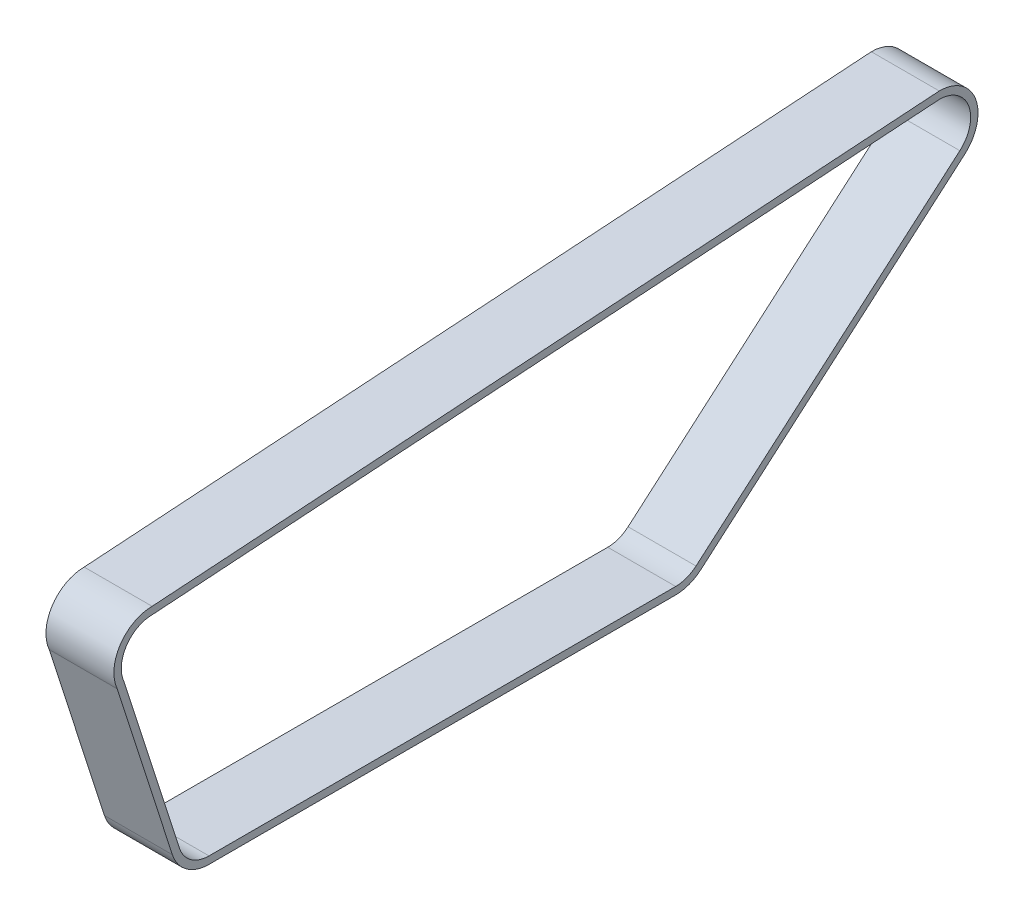
ISO-10303-21;
HEADER;
FILE_DESCRIPTION(('STEP AP214'),'2;1');
FILE_NAME('part.step','',(''),(''),'','','');
FILE_SCHEMA(('AUTOMOTIVE_DESIGN { 1 0 10303 214 1 1 1 1 }'));
ENDSEC;
DATA;
#1=APPLICATION_CONTEXT('core data for automotive mechanical design processes');
#2=APPLICATION_PROTOCOL_DEFINITION('international standard','automotive_design',2000,#1);
#3=PRODUCT_CONTEXT('',#1,'mechanical');
#4=PRODUCT('Part','Part','',(#3));
#5=PRODUCT_RELATED_PRODUCT_CATEGORY('part','',(#4));
#6=PRODUCT_DEFINITION_FORMATION('','',#4);
#7=PRODUCT_DEFINITION_CONTEXT('part definition',#1,'design');
#8=PRODUCT_DEFINITION('design','',#6,#7);
#9=PRODUCT_DEFINITION_SHAPE('','',#8);
#10=(LENGTH_UNIT() NAMED_UNIT(*) SI_UNIT(.MILLI.,.METRE.));
#11=(NAMED_UNIT(*) PLANE_ANGLE_UNIT() SI_UNIT($,.RADIAN.));
#12=(NAMED_UNIT(*) SI_UNIT($,.STERADIAN.) SOLID_ANGLE_UNIT());
#13=UNCERTAINTY_MEASURE_WITH_UNIT(LENGTH_MEASURE(1.E-05),#10,'distance_accuracy_value','');
#14=(GEOMETRIC_REPRESENTATION_CONTEXT(3) GLOBAL_UNCERTAINTY_ASSIGNED_CONTEXT((#13)) GLOBAL_UNIT_ASSIGNED_CONTEXT((#10,
#11,#12)) REPRESENTATION_CONTEXT('',''));
#15=CARTESIAN_POINT('',(0.,0.,0.));
#16=DIRECTION('',(0.,0.,1.));
#17=DIRECTION('',(1.,0.,0.));
#18=AXIS2_PLACEMENT_3D('',#15,#16,#17);
#19=CARTESIAN_POINT('',(-41.5,667.83027642642,-247.294162985995));
#20=DIRECTION('',(-1.,0.,0.));
#21=DIRECTION('',(0.,0.,1.));
#22=AXIS2_PLACEMENT_3D('',#19,#20,#21);
#23=PLANE('',#22);
#24=CARTESIAN_POINT('',(-41.5,667.83027642642,-247.294162985995));
#25=DIRECTION('',(-1.,0.,0.));
#26=DIRECTION('',(0.,0.,1.));
#27=AXIS2_PLACEMENT_3D('',#24,#25,#26);
#28=CIRCLE('',#27,23.5);
#29=CARTESIAN_POINT('',(-41.5,691.32974219817,-247.135706549221));
#30=VERTEX_POINT('',#29);
#31=CARTESIAN_POINT('',(-41.5,650.041273838367,-262.649988816026));
#32=VERTEX_POINT('',#31);
#33=EDGE_CURVE('E213',#30,#32,#28,.T.);
#34=ORIENTED_EDGE('',*,*,#33,.T.);
#35=DIRECTION('',(0.,-0.653439397022579,0.75697883353418));
#36=VECTOR('',#35,1.);
#37=CARTESIAN_POINT('',(-41.5,650.041273838367,-262.649988816026));
#38=LINE('',#37,#36);
#39=CARTESIAN_POINT('',(-41.5,510.923378563404,-101.488444885835));
#40=VERTEX_POINT('',#39);
#41=EDGE_CURVE('E216',#32,#40,#38,.T.);
#42=ORIENTED_EDGE('',*,*,#41,.T.);
#43=CARTESIAN_POINT('',(-41.5,528.712381151457,-86.1326190558044));
#44=DIRECTION('',(-1.,0.,0.));
#45=DIRECTION('',(0.,0.,1.));
#46=AXIS2_PLACEMENT_3D('',#43,#44,#45);
#47=CIRCLE('',#46,23.5);
#48=CARTESIAN_POINT('',(-41.5,505.212381151457,-86.1326190558044));
#49=VERTEX_POINT('',#48);
#50=EDGE_CURVE('E219',#40,#49,#47,.T.);
#51=ORIENTED_EDGE('',*,*,#50,.T.);
#52=DIRECTION('',(0.,0.,1.));
#53=VECTOR('',#52,1.);
#54=CARTESIAN_POINT('',(-41.5,505.212381151457,-86.1326190558044));
#55=LINE('',#54,#53);
#56=CARTESIAN_POINT('',(-41.5,505.212381151457,198.925533747887));
#57=VERTEX_POINT('',#56);
#58=EDGE_CURVE('E221',#49,#57,#55,.T.);
#59=ORIENTED_EDGE('',*,*,#58,.T.);
#60=CARTESIAN_POINT('',(-41.5,528.712381151457,198.925533747887));
#61=DIRECTION('',(-1.,0.,0.));
#62=DIRECTION('',(0.,0.,1.));
#63=AXIS2_PLACEMENT_3D('',#60,#61,#62);
#64=CIRCLE('',#63,23.5);
#65=CARTESIAN_POINT('',(-41.5,521.502399446625,221.292164334901));
#66=VERTEX_POINT('',#65);
#67=EDGE_CURVE('E223',#57,#66,#64,.T.);
#68=ORIENTED_EDGE('',*,*,#67,.T.);
#69=DIRECTION('',(0.,0.951771514341053,0.306807732120524));
#70=VECTOR('',#69,1.);
#71=CARTESIAN_POINT('',(-41.5,626.142600064491,255.023393055726));
#72=LINE('',#71,#70);
#73=CARTESIAN_POINT('',(-41.5,626.142600064491,255.023393055726));
#74=VERTEX_POINT('',#73);
#75=EDGE_CURVE('E225',#66,#74,#72,.T.);
#76=ORIENTED_EDGE('',*,*,#75,.T.);
#77=CARTESIAN_POINT('',(-41.5,635.637524386992,233.526965163873));
#78=DIRECTION('',(-1.,0.,0.));
#79=DIRECTION('',(0.,0.,1.));
#80=AXIS2_PLACEMENT_3D('',#77,#78,#79);
#81=CIRCLE('',#80,23.4999999999932);
#82=CARTESIAN_POINT('',(-41.5,659.136990158735,233.685421600647));
#83=VERTEX_POINT('',#82);
#84=EDGE_CURVE('E227',#74,#83,#81,.T.);
#85=ORIENTED_EDGE('',*,*,#84,.T.);
#86=DIRECTION('',(0.,0.0668041295607367,-0.997766109002321));
#87=VECTOR('',#86,1.);
#88=CARTESIAN_POINT('',(-41.5,691.32974219817,-247.135706549221));
#89=LINE('',#88,#87);
#90=EDGE_CURVE('E229',#83,#30,#89,.T.);
#91=ORIENTED_EDGE('',*,*,#90,.T.);
#92=EDGE_LOOP('',(#34,#42,#51,#59,#68,#76,#85,#91));
#93=FACE_BOUND('',#92,.T.);
#94=DIRECTION('',(0.,0.951771514341053,0.306807732120524));
#95=VECTOR('',#94,1.);
#96=CARTESIAN_POINT('',(-41.5,627.758227005056,250.816171992607));
#97=LINE('',#96,#95);
#98=CARTESIAN_POINT('',(-41.5,522.883034241167,217.009192520367));
#99=VERTEX_POINT('',#98);
#100=CARTESIAN_POINT('',(-41.5,627.758227005056,250.816171992607));
#101=VERTEX_POINT('',#100);
#102=EDGE_CURVE('E156',#99,#101,#97,.T.);
#103=ORIENTED_EDGE('',*,*,#102,.F.);
#104=CARTESIAN_POINT('',(-41.5,528.712381151457,198.925533747887));
#105=DIRECTION('',(-1.,0.,0.));
#106=DIRECTION('',(0.,0.,1.));
#107=AXIS2_PLACEMENT_3D('',#104,#105,#106);
#108=CIRCLE('',#107,19.);
#109=CARTESIAN_POINT('',(-41.5,509.712381151457,198.925533747887));
#110=VERTEX_POINT('',#109);
#111=EDGE_CURVE('E148',#110,#99,#108,.T.);
#112=ORIENTED_EDGE('',*,*,#111,.F.);
#113=DIRECTION('',(0.,0.,1.));
#114=VECTOR('',#113,1.);
#115=CARTESIAN_POINT('',(-41.5,509.712381151457,-86.1326190558044));
#116=LINE('',#115,#114);
#117=CARTESIAN_POINT('',(-41.5,509.712381151457,-86.1326190558044));
#118=VERTEX_POINT('',#117);
#119=EDGE_CURVE('E181',#118,#110,#116,.T.);
#120=ORIENTED_EDGE('',*,*,#119,.F.);
#121=CARTESIAN_POINT('',(-41.5,528.712381151457,-86.1326190558044));
#122=DIRECTION('',(-1.,0.,0.));
#123=DIRECTION('',(0.,0.,1.));
#124=AXIS2_PLACEMENT_3D('',#121,#122,#123);
#125=CIRCLE('',#124,19.);
#126=CARTESIAN_POINT('',(-41.5,514.329783314308,-98.5479675992334));
#127=VERTEX_POINT('',#126);
#128=EDGE_CURVE('E179',#127,#118,#125,.T.);
#129=ORIENTED_EDGE('',*,*,#128,.F.);
#130=DIRECTION('',(0.,-0.653439397022579,0.756978833534181));
#131=VECTOR('',#130,1.);
#132=CARTESIAN_POINT('',(-41.5,653.447678589271,-259.709511529424));
#133=LINE('',#132,#131);
#134=CARTESIAN_POINT('',(-41.5,653.447678589271,-259.709511529424));
#135=VERTEX_POINT('',#134);
#136=EDGE_CURVE('E177',#135,#127,#133,.T.);
#137=ORIENTED_EDGE('',*,*,#136,.F.);
#138=CARTESIAN_POINT('',(-41.5,667.83027642642,-247.294162985995));
#139=DIRECTION('',(-1.,0.,0.));
#140=DIRECTION('',(0.,0.,1.));
#141=AXIS2_PLACEMENT_3D('',#138,#139,#140);
#142=CIRCLE('',#141,19.);
#143=CARTESIAN_POINT('',(-41.5,686.83027642642,-247.294162985995));
#144=VERTEX_POINT('',#143);
#145=EDGE_CURVE('E175',#144,#135,#142,.T.);
#146=ORIENTED_EDGE('',*,*,#145,.F.);
#147=DIRECTION('',(0.,0.0668041295607367,-0.997766109002321));
#148=VECTOR('',#147,1.);
#149=CARTESIAN_POINT('',(-41.5,686.83027642642,-247.294162985995));
#150=LINE('',#149,#148);
#151=CARTESIAN_POINT('',(-41.5,654.637524386985,233.526965163873));
#152=VERTEX_POINT('',#151);
#153=EDGE_CURVE('E171',#152,#144,#150,.T.);
#154=ORIENTED_EDGE('',*,*,#153,.F.);
#155=CARTESIAN_POINT('',(-41.5,635.637524386992,233.526965163873));
#156=DIRECTION('',(-1.,0.,0.));
#157=DIRECTION('',(0.,0.,1.));
#158=AXIS2_PLACEMENT_3D('',#155,#156,#157);
#159=CIRCLE('',#158,18.9999999999931);
#160=EDGE_CURVE('E169',#101,#152,#159,.T.);
#161=ORIENTED_EDGE('',*,*,#160,.F.);
#162=EDGE_LOOP('',(#103,#112,#120,#129,#137,#146,#154,#161));
#163=FACE_BOUND('',#162,.T.);
#164=ADVANCED_FACE('F35',(#93,#163),#23,.T.);
#165=CARTESIAN_POINT('',(0.,667.83027642642,-247.294162985995));
#166=DIRECTION('',(-1.,0.,0.));
#167=DIRECTION('',(0.,0.,1.));
#168=AXIS2_PLACEMENT_3D('',#165,#166,#167);
#169=PLANE('',#168);
#170=CARTESIAN_POINT('',(0.,667.83027642642,-247.294162985995));
#171=DIRECTION('',(-1.,0.,0.));
#172=DIRECTION('',(0.,0.,1.));
#173=AXIS2_PLACEMENT_3D('',#170,#171,#172);
#174=CIRCLE('',#173,23.5);
#175=CARTESIAN_POINT('',(0.,691.32974219817,-247.135706549221));
#176=VERTEX_POINT('',#175);
#177=CARTESIAN_POINT('',(0.,650.041273838367,-262.649988816026));
#178=VERTEX_POINT('',#177);
#179=EDGE_CURVE('E164',#176,#178,#174,.T.);
#180=ORIENTED_EDGE('',*,*,#179,.F.);
#181=DIRECTION('',(0.,0.0668041295607367,-0.997766109002321));
#182=VECTOR('',#181,1.);
#183=CARTESIAN_POINT('',(0.,691.32974219817,-247.135706549221));
#184=LINE('',#183,#182);
#185=CARTESIAN_POINT('',(0.,659.136990158735,233.685421600647));
#186=VERTEX_POINT('',#185);
#187=EDGE_CURVE('E217',#186,#176,#184,.T.);
#188=ORIENTED_EDGE('',*,*,#187,.F.);
#189=CARTESIAN_POINT('',(0.,635.637524386992,233.526965163873));
#190=DIRECTION('',(-1.,0.,0.));
#191=DIRECTION('',(0.,0.,1.));
#192=AXIS2_PLACEMENT_3D('',#189,#190,#191);
#193=CIRCLE('',#192,23.4999999999932);
#194=CARTESIAN_POINT('',(0.,626.142600064491,255.023393055726));
#195=VERTEX_POINT('',#194);
#196=EDGE_CURVE('E244',#195,#186,#193,.T.);
#197=ORIENTED_EDGE('',*,*,#196,.F.);
#198=DIRECTION('',(0.,0.951771514341053,0.306807732120524));
#199=VECTOR('',#198,1.);
#200=CARTESIAN_POINT('',(0.,626.142600064491,255.023393055726));
#201=LINE('',#200,#199);
#202=CARTESIAN_POINT('',(0.,521.502399446625,221.292164334901));
#203=VERTEX_POINT('',#202);
#204=EDGE_CURVE('E242',#203,#195,#201,.T.);
#205=ORIENTED_EDGE('',*,*,#204,.F.);
#206=CARTESIAN_POINT('',(0.,528.712381151457,198.925533747887));
#207=DIRECTION('',(-1.,0.,0.));
#208=DIRECTION('',(0.,0.,1.));
#209=AXIS2_PLACEMENT_3D('',#206,#207,#208);
#210=CIRCLE('',#209,23.5);
#211=CARTESIAN_POINT('',(0.,505.212381151457,198.925533747887));
#212=VERTEX_POINT('',#211);
#213=EDGE_CURVE('E240',#212,#203,#210,.T.);
#214=ORIENTED_EDGE('',*,*,#213,.F.);
#215=DIRECTION('',(0.,0.,1.));
#216=VECTOR('',#215,1.);
#217=CARTESIAN_POINT('',(0.,505.212381151457,-86.1326190558044));
#218=LINE('',#217,#216);
#219=CARTESIAN_POINT('',(0.,505.212381151457,-86.1326190558044));
#220=VERTEX_POINT('',#219);
#221=EDGE_CURVE('E238',#220,#212,#218,.T.);
#222=ORIENTED_EDGE('',*,*,#221,.F.);
#223=CARTESIAN_POINT('',(0.,528.712381151457,-86.1326190558044));
#224=DIRECTION('',(-1.,0.,0.));
#225=DIRECTION('',(0.,0.,1.));
#226=AXIS2_PLACEMENT_3D('',#223,#224,#225);
#227=CIRCLE('',#226,23.5);
#228=CARTESIAN_POINT('',(0.,510.923378563404,-101.488444885835));
#229=VERTEX_POINT('',#228);
#230=EDGE_CURVE('E236',#229,#220,#227,.T.);
#231=ORIENTED_EDGE('',*,*,#230,.F.);
#232=DIRECTION('',(0.,-0.653439397022579,0.75697883353418));
#233=VECTOR('',#232,1.);
#234=CARTESIAN_POINT('',(0.,650.041273838367,-262.649988816026));
#235=LINE('',#234,#233);
#236=EDGE_CURVE('E234',#178,#229,#235,.T.);
#237=ORIENTED_EDGE('',*,*,#236,.F.);
#238=EDGE_LOOP('',(#180,#188,#197,#205,#214,#222,#231,#237));
#239=FACE_BOUND('',#238,.T.);
#240=CARTESIAN_POINT('',(0.,528.712381151457,198.925533747887));
#241=DIRECTION('',(-1.,0.,0.));
#242=DIRECTION('',(0.,0.,1.));
#243=AXIS2_PLACEMENT_3D('',#240,#241,#242);
#244=CIRCLE('',#243,19.);
#245=CARTESIAN_POINT('',(0.,509.712381151457,198.925533747887));
#246=VERTEX_POINT('',#245);
#247=CARTESIAN_POINT('',(0.,522.883034241167,217.009192520367));
#248=VERTEX_POINT('',#247);
#249=EDGE_CURVE('E58',#246,#248,#244,.T.);
#250=ORIENTED_EDGE('',*,*,#249,.T.);
#251=DIRECTION('',(0.,0.951771514341053,0.306807732120524));
#252=VECTOR('',#251,1.);
#253=CARTESIAN_POINT('',(0.,627.758227005056,250.816171992607));
#254=LINE('',#253,#252);
#255=CARTESIAN_POINT('',(0.,627.758227005056,250.816171992607));
#256=VERTEX_POINT('',#255);
#257=EDGE_CURVE('E163',#248,#256,#254,.T.);
#258=ORIENTED_EDGE('',*,*,#257,.T.);
#259=CARTESIAN_POINT('',(0.,635.637524386992,233.526965163873));
#260=DIRECTION('',(-1.,0.,0.));
#261=DIRECTION('',(0.,0.,1.));
#262=AXIS2_PLACEMENT_3D('',#259,#260,#261);
#263=CIRCLE('',#262,18.9999999999931);
#264=CARTESIAN_POINT('',(0.,654.637524386985,233.526965163873));
#265=VERTEX_POINT('',#264);
#266=EDGE_CURVE('E185',#256,#265,#263,.T.);
#267=ORIENTED_EDGE('',*,*,#266,.T.);
#268=DIRECTION('',(0.,0.0668041295607367,-0.997766109002321));
#269=VECTOR('',#268,1.);
#270=CARTESIAN_POINT('',(0.,686.83027642642,-247.294162985995));
#271=LINE('',#270,#269);
#272=CARTESIAN_POINT('',(0.,686.83027642642,-247.294162985995));
#273=VERTEX_POINT('',#272);
#274=EDGE_CURVE('E188',#265,#273,#271,.T.);
#275=ORIENTED_EDGE('',*,*,#274,.T.);
#276=CARTESIAN_POINT('',(0.,667.83027642642,-247.294162985995));
#277=DIRECTION('',(-1.,0.,0.));
#278=DIRECTION('',(0.,0.,1.));
#279=AXIS2_PLACEMENT_3D('',#276,#277,#278);
#280=CIRCLE('',#279,19.);
#281=CARTESIAN_POINT('',(0.,653.447678589271,-259.709511529424));
#282=VERTEX_POINT('',#281);
#283=EDGE_CURVE('E191',#273,#282,#280,.T.);
#284=ORIENTED_EDGE('',*,*,#283,.T.);
#285=DIRECTION('',(0.,-0.653439397022579,0.756978833534181));
#286=VECTOR('',#285,1.);
#287=CARTESIAN_POINT('',(0.,653.447678589271,-259.709511529424));
#288=LINE('',#287,#286);
#289=CARTESIAN_POINT('',(0.,514.329783314308,-98.5479675992334));
#290=VERTEX_POINT('',#289);
#291=EDGE_CURVE('E194',#282,#290,#288,.T.);
#292=ORIENTED_EDGE('',*,*,#291,.T.);
#293=CARTESIAN_POINT('',(0.,528.712381151457,-86.1326190558044));
#294=DIRECTION('',(-1.,0.,0.));
#295=DIRECTION('',(0.,0.,1.));
#296=AXIS2_PLACEMENT_3D('',#293,#294,#295);
#297=CIRCLE('',#296,19.);
#298=CARTESIAN_POINT('',(0.,509.712381151457,-86.1326190558044));
#299=VERTEX_POINT('',#298);
#300=EDGE_CURVE('E197',#290,#299,#297,.T.);
#301=ORIENTED_EDGE('',*,*,#300,.T.);
#302=DIRECTION('',(0.,0.,1.));
#303=VECTOR('',#302,1.);
#304=CARTESIAN_POINT('',(0.,509.712381151457,-86.1326190558044));
#305=LINE('',#304,#303);
#306=EDGE_CURVE('E157',#299,#246,#305,.T.);
#307=ORIENTED_EDGE('',*,*,#306,.T.);
#308=EDGE_LOOP('',(#250,#258,#267,#275,#284,#292,#301,#307));
#309=FACE_BOUND('',#308,.T.);
#310=ADVANCED_FACE('F274',(#239,#309),#169,.F.);
#311=CARTESIAN_POINT('',(-41.5,667.83027642642,-247.294162985995));
#312=DIRECTION('',(1.,0.,0.));
#313=DIRECTION('',(0.,0.,-1.));
#314=AXIS2_PLACEMENT_3D('',#311,#312,#313);
#315=CYLINDRICAL_SURFACE('',#314,23.5);
#316=ORIENTED_EDGE('',*,*,#179,.T.);
#317=DIRECTION('',(1.,0.,0.));
#318=VECTOR('',#317,1.);
#319=CARTESIAN_POINT('',(-41.5,650.041273838367,-262.649988816026));
#320=LINE('',#319,#318);
#321=EDGE_CURVE('E11',#32,#178,#320,.T.);
#322=ORIENTED_EDGE('',*,*,#321,.F.);
#323=ORIENTED_EDGE('',*,*,#33,.F.);
#324=DIRECTION('',(1.,0.,0.));
#325=VECTOR('',#324,1.);
#326=CARTESIAN_POINT('',(-41.5,691.32974219817,-247.135706549221));
#327=LINE('',#326,#325);
#328=EDGE_CURVE('E231',#30,#176,#327,.T.);
#329=ORIENTED_EDGE('',*,*,#328,.T.);
#330=EDGE_LOOP('',(#316,#322,#323,#329));
#331=FACE_BOUND('',#330,.T.);
#332=ADVANCED_FACE('F37',(#331),#315,.T.);
#333=CARTESIAN_POINT('',(-41.5,650.041273838367,-262.649988816026));
#334=DIRECTION('',(0.,0.756978833534181,0.653439397022579));
#335=DIRECTION('',(0.,-0.653439397022579,0.756978833534181));
#336=AXIS2_PLACEMENT_3D('',#333,#334,#335);
#337=PLANE('',#336);
#338=ORIENTED_EDGE('',*,*,#236,.T.);
#339=DIRECTION('',(1.,0.,0.));
#340=VECTOR('',#339,1.);
#341=CARTESIAN_POINT('',(-41.5,510.923378563404,-101.488444885835));
#342=LINE('',#341,#340);
#343=EDGE_CURVE('E43',#40,#229,#342,.T.);
#344=ORIENTED_EDGE('',*,*,#343,.F.);
#345=ORIENTED_EDGE('',*,*,#41,.F.);
#346=ORIENTED_EDGE('',*,*,#321,.T.);
#347=EDGE_LOOP('',(#338,#344,#345,#346));
#348=FACE_BOUND('',#347,.T.);
#349=ADVANCED_FACE('F291',(#348),#337,.F.);
#350=CARTESIAN_POINT('',(-41.5,528.712381151457,-86.1326190558044));
#351=DIRECTION('',(1.,0.,0.));
#352=DIRECTION('',(0.,0.,-1.));
#353=AXIS2_PLACEMENT_3D('',#350,#351,#352);
#354=CYLINDRICAL_SURFACE('',#353,23.5);
#355=ORIENTED_EDGE('',*,*,#230,.T.);
#356=DIRECTION('',(1.,0.,0.));
#357=VECTOR('',#356,1.);
#358=CARTESIAN_POINT('',(-41.5,505.212381151457,-86.1326190558044));
#359=LINE('',#358,#357);
#360=EDGE_CURVE('E261',#49,#220,#359,.T.);
#361=ORIENTED_EDGE('',*,*,#360,.F.);
#362=ORIENTED_EDGE('',*,*,#50,.F.);
#363=ORIENTED_EDGE('',*,*,#343,.T.);
#364=EDGE_LOOP('',(#355,#361,#362,#363));
#365=FACE_BOUND('',#364,.T.);
#366=ADVANCED_FACE('F268',(#365),#354,.T.);
#367=CARTESIAN_POINT('',(-41.5,505.212381151457,-86.1326190558044));
#368=DIRECTION('',(0.,1.,0.));
#369=DIRECTION('',(0.,0.,1.));
#370=AXIS2_PLACEMENT_3D('',#367,#368,#369);
#371=PLANE('',#370);
#372=ORIENTED_EDGE('',*,*,#221,.T.);
#373=DIRECTION('',(1.,0.,0.));
#374=VECTOR('',#373,1.);
#375=CARTESIAN_POINT('',(-41.5,505.212381151457,198.925533747887));
#376=LINE('',#375,#374);
#377=EDGE_CURVE('E258',#57,#212,#376,.T.);
#378=ORIENTED_EDGE('',*,*,#377,.F.);
#379=ORIENTED_EDGE('',*,*,#58,.F.);
#380=ORIENTED_EDGE('',*,*,#360,.T.);
#381=EDGE_LOOP('',(#372,#378,#379,#380));
#382=FACE_BOUND('',#381,.T.);
#383=ADVANCED_FACE('F280',(#382),#371,.F.);
#384=CARTESIAN_POINT('',(-41.5,528.712381151457,198.925533747887));
#385=DIRECTION('',(1.,0.,0.));
#386=DIRECTION('',(0.,0.,-1.));
#387=AXIS2_PLACEMENT_3D('',#384,#385,#386);
#388=CYLINDRICAL_SURFACE('',#387,23.5);
#389=ORIENTED_EDGE('',*,*,#213,.T.);
#390=DIRECTION('',(1.,0.,0.));
#391=VECTOR('',#390,1.);
#392=CARTESIAN_POINT('',(-41.5,521.502399446625,221.292164334901));
#393=LINE('',#392,#391);
#394=EDGE_CURVE('E255',#66,#203,#393,.T.);
#395=ORIENTED_EDGE('',*,*,#394,.F.);
#396=ORIENTED_EDGE('',*,*,#67,.F.);
#397=ORIENTED_EDGE('',*,*,#377,.T.);
#398=EDGE_LOOP('',(#389,#395,#396,#397));
#399=FACE_BOUND('',#398,.T.);
#400=ADVANCED_FACE('F284',(#399),#388,.T.);
#401=CARTESIAN_POINT('',(-41.5,626.142600064491,255.023393055726));
#402=DIRECTION('',(0.,0.306807732120524,-0.951771514341053));
#403=DIRECTION('',(0.,0.951771514341053,0.306807732120524));
#404=AXIS2_PLACEMENT_3D('',#401,#402,#403);
#405=PLANE('',#404);
#406=ORIENTED_EDGE('',*,*,#204,.T.);
#407=DIRECTION('',(1.,0.,0.));
#408=VECTOR('',#407,1.);
#409=CARTESIAN_POINT('',(-41.5,626.142600064491,255.023393055726));
#410=LINE('',#409,#408);
#411=EDGE_CURVE('E252',#74,#195,#410,.T.);
#412=ORIENTED_EDGE('',*,*,#411,.F.);
#413=ORIENTED_EDGE('',*,*,#75,.F.);
#414=ORIENTED_EDGE('',*,*,#394,.T.);
#415=EDGE_LOOP('',(#406,#412,#413,#414));
#416=FACE_BOUND('',#415,.T.);
#417=ADVANCED_FACE('F304',(#416),#405,.F.);
#418=CARTESIAN_POINT('',(-41.5,635.637524386992,233.526965163873));
#419=DIRECTION('',(1.,0.,0.));
#420=DIRECTION('',(0.,0.,-1.));
#421=AXIS2_PLACEMENT_3D('',#418,#419,#420);
#422=CYLINDRICAL_SURFACE('',#421,23.4999999999932);
#423=ORIENTED_EDGE('',*,*,#196,.T.);
#424=DIRECTION('',(1.,0.,0.));
#425=VECTOR('',#424,1.);
#426=CARTESIAN_POINT('',(-41.5,659.136990158735,233.685421600647));
#427=LINE('',#426,#425);
#428=EDGE_CURVE('E249',#83,#186,#427,.T.);
#429=ORIENTED_EDGE('',*,*,#428,.F.);
#430=ORIENTED_EDGE('',*,*,#84,.F.);
#431=ORIENTED_EDGE('',*,*,#411,.T.);
#432=EDGE_LOOP('',(#423,#429,#430,#431));
#433=FACE_BOUND('',#432,.T.);
#434=ADVANCED_FACE('F302',(#433),#422,.T.);
#435=CARTESIAN_POINT('',(-41.5,691.32974219817,-247.135706549221));
#436=DIRECTION('',(0.,-0.997766109002321,-0.0668041295607367));
#437=DIRECTION('',(0.,0.0668041295607367,-0.997766109002322));
#438=AXIS2_PLACEMENT_3D('',#435,#436,#437);
#439=PLANE('',#438);
#440=ORIENTED_EDGE('',*,*,#187,.T.);
#441=ORIENTED_EDGE('',*,*,#328,.F.);
#442=ORIENTED_EDGE('',*,*,#90,.F.);
#443=ORIENTED_EDGE('',*,*,#428,.T.);
#444=EDGE_LOOP('',(#440,#441,#442,#443));
#445=FACE_BOUND('',#444,.T.);
#446=ADVANCED_FACE('F297',(#445),#439,.F.);
#447=CARTESIAN_POINT('',(-41.5,528.712381151457,198.925533747887));
#448=DIRECTION('',(1.,0.,0.));
#449=DIRECTION('',(0.,0.,-1.));
#450=AXIS2_PLACEMENT_3D('',#447,#448,#449);
#451=CYLINDRICAL_SURFACE('',#450,19.);
#452=ORIENTED_EDGE('',*,*,#249,.F.);
#453=DIRECTION('',(1.,0.,0.));
#454=VECTOR('',#453,1.);
#455=CARTESIAN_POINT('',(-41.5,509.712381151457,198.925533747887));
#456=LINE('',#455,#454);
#457=EDGE_CURVE('E152',#110,#246,#456,.T.);
#458=ORIENTED_EDGE('',*,*,#457,.F.);
#459=ORIENTED_EDGE('',*,*,#111,.T.);
#460=DIRECTION('',(1.,0.,0.));
#461=VECTOR('',#460,1.);
#462=CARTESIAN_POINT('',(-41.5,522.883034241167,217.009192520367));
#463=LINE('',#462,#461);
#464=EDGE_CURVE('E151',#99,#248,#463,.T.);
#465=ORIENTED_EDGE('',*,*,#464,.T.);
#466=EDGE_LOOP('',(#452,#458,#459,#465));
#467=FACE_BOUND('',#466,.T.);
#468=ADVANCED_FACE('F150',(#467),#451,.F.);
#469=CARTESIAN_POINT('',(-41.5,627.758227005056,250.816171992607));
#470=DIRECTION('',(0.,0.306807732120524,-0.951771514341053));
#471=DIRECTION('',(0.,0.951771514341053,0.306807732120524));
#472=AXIS2_PLACEMENT_3D('',#469,#470,#471);
#473=PLANE('',#472);
#474=ORIENTED_EDGE('',*,*,#257,.F.);
#475=ORIENTED_EDGE('',*,*,#464,.F.);
#476=ORIENTED_EDGE('',*,*,#102,.T.);
#477=DIRECTION('',(1.,0.,0.));
#478=VECTOR('',#477,1.);
#479=CARTESIAN_POINT('',(-41.5,627.758227005056,250.816171992607));
#480=LINE('',#479,#478);
#481=EDGE_CURVE('E165',#101,#256,#480,.T.);
#482=ORIENTED_EDGE('',*,*,#481,.T.);
#483=EDGE_LOOP('',(#474,#475,#476,#482));
#484=FACE_BOUND('',#483,.T.);
#485=ADVANCED_FACE('F160',(#484),#473,.T.);
#486=CARTESIAN_POINT('',(-41.5,635.637524386992,233.526965163873));
#487=DIRECTION('',(1.,0.,0.));
#488=DIRECTION('',(0.,0.,-1.));
#489=AXIS2_PLACEMENT_3D('',#486,#487,#488);
#490=CYLINDRICAL_SURFACE('',#489,18.9999999999931);
#491=ORIENTED_EDGE('',*,*,#266,.F.);
#492=ORIENTED_EDGE('',*,*,#481,.F.);
#493=ORIENTED_EDGE('',*,*,#160,.T.);
#494=DIRECTION('',(1.,0.,0.));
#495=VECTOR('',#494,1.);
#496=CARTESIAN_POINT('',(-41.5,654.637524386985,233.526965163873));
#497=LINE('',#496,#495);
#498=EDGE_CURVE('E210',#152,#265,#497,.T.);
#499=ORIENTED_EDGE('',*,*,#498,.T.);
#500=EDGE_LOOP('',(#491,#492,#493,#499));
#501=FACE_BOUND('',#500,.T.);
#502=ADVANCED_FACE('F329',(#501),#490,.F.);
#503=CARTESIAN_POINT('',(-41.5,686.83027642642,-247.294162985995));
#504=DIRECTION('',(0.,-0.997766109002321,-0.0668041295607367));
#505=DIRECTION('',(0.,0.0668041295607367,-0.997766109002322));
#506=AXIS2_PLACEMENT_3D('',#503,#504,#505);
#507=PLANE('',#506);
#508=ORIENTED_EDGE('',*,*,#274,.F.);
#509=ORIENTED_EDGE('',*,*,#498,.F.);
#510=ORIENTED_EDGE('',*,*,#153,.T.);
#511=DIRECTION('',(1.,0.,0.));
#512=VECTOR('',#511,1.);
#513=CARTESIAN_POINT('',(-41.5,686.83027642642,-247.294162985995));
#514=LINE('',#513,#512);
#515=EDGE_CURVE('E208',#144,#273,#514,.T.);
#516=ORIENTED_EDGE('',*,*,#515,.T.);
#517=EDGE_LOOP('',(#508,#509,#510,#516));
#518=FACE_BOUND('',#517,.T.);
#519=ADVANCED_FACE('F333',(#518),#507,.T.);
#520=CARTESIAN_POINT('',(-41.5,667.83027642642,-247.294162985995));
#521=DIRECTION('',(1.,0.,0.));
#522=DIRECTION('',(0.,0.,-1.));
#523=AXIS2_PLACEMENT_3D('',#520,#521,#522);
#524=CYLINDRICAL_SURFACE('',#523,19.);
#525=ORIENTED_EDGE('',*,*,#283,.F.);
#526=ORIENTED_EDGE('',*,*,#515,.F.);
#527=ORIENTED_EDGE('',*,*,#145,.T.);
#528=DIRECTION('',(1.,0.,0.));
#529=VECTOR('',#528,1.);
#530=CARTESIAN_POINT('',(-41.5,653.447678589271,-259.709511529424));
#531=LINE('',#530,#529);
#532=EDGE_CURVE('E206',#135,#282,#531,.T.);
#533=ORIENTED_EDGE('',*,*,#532,.T.);
#534=EDGE_LOOP('',(#525,#526,#527,#533));
#535=FACE_BOUND('',#534,.T.);
#536=ADVANCED_FACE('F339',(#535),#524,.F.);
#537=CARTESIAN_POINT('',(-41.5,653.447678589271,-259.709511529424));
#538=DIRECTION('',(0.,0.756978833534181,0.653439397022579));
#539=DIRECTION('',(0.,-0.653439397022579,0.756978833534181));
#540=AXIS2_PLACEMENT_3D('',#537,#538,#539);
#541=PLANE('',#540);
#542=ORIENTED_EDGE('',*,*,#291,.F.);
#543=ORIENTED_EDGE('',*,*,#532,.F.);
#544=ORIENTED_EDGE('',*,*,#136,.T.);
#545=DIRECTION('',(1.,0.,0.));
#546=VECTOR('',#545,1.);
#547=CARTESIAN_POINT('',(-41.5,514.329783314308,-98.5479675992334));
#548=LINE('',#547,#546);
#549=EDGE_CURVE('E204',#127,#290,#548,.T.);
#550=ORIENTED_EDGE('',*,*,#549,.T.);
#551=EDGE_LOOP('',(#542,#543,#544,#550));
#552=FACE_BOUND('',#551,.T.);
#553=ADVANCED_FACE('F343',(#552),#541,.T.);
#554=CARTESIAN_POINT('',(-41.5,528.712381151457,-86.1326190558044));
#555=DIRECTION('',(1.,0.,0.));
#556=DIRECTION('',(0.,0.,-1.));
#557=AXIS2_PLACEMENT_3D('',#554,#555,#556);
#558=CYLINDRICAL_SURFACE('',#557,19.);
#559=ORIENTED_EDGE('',*,*,#300,.F.);
#560=ORIENTED_EDGE('',*,*,#549,.F.);
#561=ORIENTED_EDGE('',*,*,#128,.T.);
#562=DIRECTION('',(1.,0.,0.));
#563=VECTOR('',#562,1.);
#564=CARTESIAN_POINT('',(-41.5,509.712381151457,-86.1326190558044));
#565=LINE('',#564,#563);
#566=EDGE_CURVE('E50',#118,#299,#565,.T.);
#567=ORIENTED_EDGE('',*,*,#566,.T.);
#568=EDGE_LOOP('',(#559,#560,#561,#567));
#569=FACE_BOUND('',#568,.T.);
#570=ADVANCED_FACE('F347',(#569),#558,.F.);
#571=CARTESIAN_POINT('',(-41.5,509.712381151457,-86.1326190558044));
#572=DIRECTION('',(0.,1.,0.));
#573=DIRECTION('',(0.,0.,1.));
#574=AXIS2_PLACEMENT_3D('',#571,#572,#573);
#575=PLANE('',#574);
#576=ORIENTED_EDGE('',*,*,#306,.F.);
#577=ORIENTED_EDGE('',*,*,#566,.F.);
#578=ORIENTED_EDGE('',*,*,#119,.T.);
#579=ORIENTED_EDGE('',*,*,#457,.T.);
#580=EDGE_LOOP('',(#576,#577,#578,#579));
#581=FACE_BOUND('',#580,.T.);
#582=ADVANCED_FACE('F351',(#581),#575,.T.);
#583=CLOSED_SHELL('',(#164,#310,#332,#349,#366,#383,#400,#417,#434,#446,#468,#485,#502,#519,
#536,#553,#570,#582));
#584=MANIFOLD_SOLID_BREP('B2',#583);
#585=ADVANCED_BREP_SHAPE_REPRESENTATION('',(#18,#584),#14);
#586=SHAPE_DEFINITION_REPRESENTATION(#9,#585);
ENDSEC;
END-ISO-10303-21;
